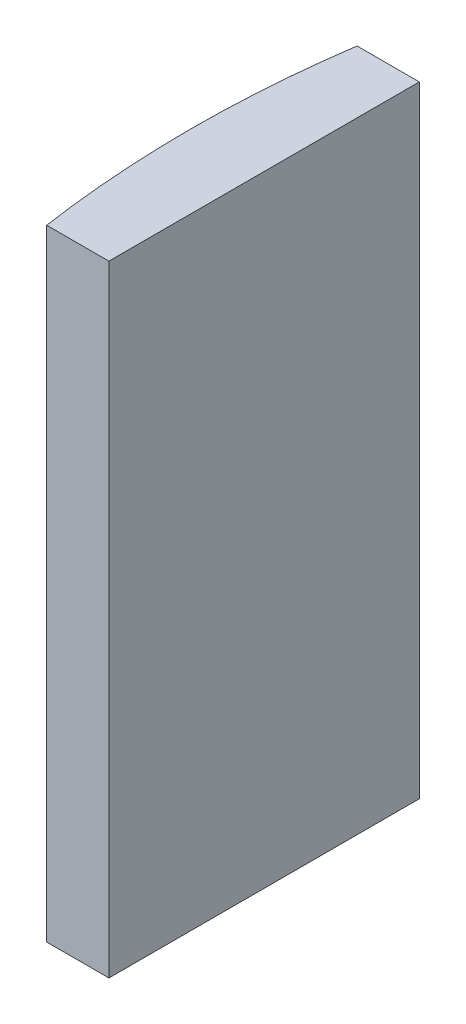
ISO-10303-21;
HEADER;
FILE_DESCRIPTION(('STEP AP214'),'2;1');
FILE_NAME('part.step','',(''),(''),'','','');
FILE_SCHEMA(('AUTOMOTIVE_DESIGN { 1 0 10303 214 1 1 1 1 }'));
ENDSEC;
DATA;
#1=APPLICATION_CONTEXT('core data for automotive mechanical design processes');
#2=APPLICATION_PROTOCOL_DEFINITION('international standard','automotive_design',2000,#1);
#3=PRODUCT_CONTEXT('',#1,'mechanical');
#4=PRODUCT('Part','Part','',(#3));
#5=PRODUCT_RELATED_PRODUCT_CATEGORY('part','',(#4));
#6=PRODUCT_DEFINITION_FORMATION('','',#4);
#7=PRODUCT_DEFINITION_CONTEXT('part definition',#1,'design');
#8=PRODUCT_DEFINITION('design','',#6,#7);
#9=PRODUCT_DEFINITION_SHAPE('','',#8);
#10=(LENGTH_UNIT() NAMED_UNIT(*) SI_UNIT(.MILLI.,.METRE.));
#11=(NAMED_UNIT(*) PLANE_ANGLE_UNIT() SI_UNIT($,.RADIAN.));
#12=(NAMED_UNIT(*) SI_UNIT($,.STERADIAN.) SOLID_ANGLE_UNIT());
#13=UNCERTAINTY_MEASURE_WITH_UNIT(LENGTH_MEASURE(1.E-05),#10,'distance_accuracy_value','');
#14=(GEOMETRIC_REPRESENTATION_CONTEXT(3) GLOBAL_UNCERTAINTY_ASSIGNED_CONTEXT((#13)) GLOBAL_UNIT_ASSIGNED_CONTEXT((#10,
#11,#12)) REPRESENTATION_CONTEXT('',''));
#15=CARTESIAN_POINT('',(0.,0.,0.));
#16=DIRECTION('',(0.,0.,1.));
#17=DIRECTION('',(1.,0.,0.));
#18=AXIS2_PLACEMENT_3D('',#15,#16,#17);
#19=CARTESIAN_POINT('',(4.35520433485127,20.,0.));
#20=DIRECTION('',(0.,-1.,0.));
#21=DIRECTION('',(0.,0.,-1.));
#22=AXIS2_PLACEMENT_3D('',#19,#20,#21);
#23=CYLINDRICAL_SURFACE('',#22,34.35);
#24=CARTESIAN_POINT('',(4.35520433485127,0.,0.));
#25=DIRECTION('',(0.,1.,0.));
#26=DIRECTION('',(0.,0.,1.));
#27=AXIS2_PLACEMENT_3D('',#24,#25,#26);
#28=CIRCLE('',#27,34.35);
#29=CARTESIAN_POINT('',(-29.6289463827995,0.,-5.));
#30=VERTEX_POINT('',#29);
#31=CARTESIAN_POINT('',(-29.6289463827995,0.,5.));
#32=VERTEX_POINT('',#31);
#33=EDGE_CURVE('E100',#30,#32,#28,.T.);
#34=ORIENTED_EDGE('',*,*,#33,.T.);
#35=DIRECTION('',(0.,-1.,0.));
#36=VECTOR('',#35,1.);
#37=CARTESIAN_POINT('',(-29.6289463827995,20.,5.));
#38=LINE('',#37,#36);
#39=CARTESIAN_POINT('',(-29.6289463827995,20.,5.));
#40=VERTEX_POINT('',#39);
#41=EDGE_CURVE('E11',#40,#32,#38,.T.);
#42=ORIENTED_EDGE('',*,*,#41,.F.);
#43=CARTESIAN_POINT('',(4.35520433485127,20.,0.));
#44=DIRECTION('',(0.,1.,0.));
#45=DIRECTION('',(0.,0.,1.));
#46=AXIS2_PLACEMENT_3D('',#43,#44,#45);
#47=CIRCLE('',#46,34.35);
#48=CARTESIAN_POINT('',(-29.6289463827995,20.,-5.));
#49=VERTEX_POINT('',#48);
#50=EDGE_CURVE('E88',#49,#40,#47,.T.);
#51=ORIENTED_EDGE('',*,*,#50,.F.);
#52=DIRECTION('',(0.,-1.,0.));
#53=VECTOR('',#52,1.);
#54=CARTESIAN_POINT('',(-29.6289463827995,20.,-5.));
#55=LINE('',#54,#53);
#56=EDGE_CURVE('E96',#49,#30,#55,.T.);
#57=ORIENTED_EDGE('',*,*,#56,.T.);
#58=EDGE_LOOP('',(#34,#42,#51,#57));
#59=FACE_BOUND('',#58,.T.);
#60=ADVANCED_FACE('F37',(#59),#23,.T.);
#61=CARTESIAN_POINT('',(-29.6289463827995,20.,5.));
#62=DIRECTION('',(0.,0.,-1.));
#63=DIRECTION('',(-1.,0.,0.));
#64=AXIS2_PLACEMENT_3D('',#61,#62,#63);
#65=PLANE('',#64);
#66=DIRECTION('',(1.,0.,0.));
#67=VECTOR('',#66,1.);
#68=CARTESIAN_POINT('',(-29.6289463827995,0.,5.));
#69=LINE('',#68,#67);
#70=CARTESIAN_POINT('',(-27.6247956651487,0.,5.));
#71=VERTEX_POINT('',#70);
#72=EDGE_CURVE('E92',#32,#71,#69,.T.);
#73=ORIENTED_EDGE('',*,*,#72,.T.);
#74=DIRECTION('',(0.,-1.,0.));
#75=VECTOR('',#74,1.);
#76=CARTESIAN_POINT('',(-27.6247956651487,20.,5.));
#77=LINE('',#76,#75);
#78=CARTESIAN_POINT('',(-27.6247956651487,20.,5.));
#79=VERTEX_POINT('',#78);
#80=EDGE_CURVE('E45',#79,#71,#77,.T.);
#81=ORIENTED_EDGE('',*,*,#80,.F.);
#82=DIRECTION('',(1.,0.,0.));
#83=VECTOR('',#82,1.);
#84=CARTESIAN_POINT('',(-29.6289463827995,20.,5.));
#85=LINE('',#84,#83);
#86=EDGE_CURVE('E83',#40,#79,#85,.T.);
#87=ORIENTED_EDGE('',*,*,#86,.F.);
#88=ORIENTED_EDGE('',*,*,#41,.T.);
#89=EDGE_LOOP('',(#73,#81,#87,#88));
#90=FACE_BOUND('',#89,.T.);
#91=ADVANCED_FACE('F91',(#90),#65,.F.);
#92=CARTESIAN_POINT('',(-27.6247956651487,20.,-5.));
#93=DIRECTION('',(-1.,0.,0.));
#94=DIRECTION('',(0.,0.,1.));
#95=AXIS2_PLACEMENT_3D('',#92,#93,#94);
#96=PLANE('',#95);
#97=DIRECTION('',(0.,0.,-1.));
#98=VECTOR('',#97,1.);
#99=CARTESIAN_POINT('',(-27.6247956651487,0.,-5.));
#100=LINE('',#99,#98);
#101=CARTESIAN_POINT('',(-27.6247956651487,0.,-5.));
#102=VERTEX_POINT('',#101);
#103=EDGE_CURVE('E70',#71,#102,#100,.T.);
#104=ORIENTED_EDGE('',*,*,#103,.T.);
#105=DIRECTION('',(0.,-1.,0.));
#106=VECTOR('',#105,1.);
#107=CARTESIAN_POINT('',(-27.6247956651487,20.,-5.));
#108=LINE('',#107,#106);
#109=CARTESIAN_POINT('',(-27.6247956651487,20.,-5.));
#110=VERTEX_POINT('',#109);
#111=EDGE_CURVE('E93',#110,#102,#108,.T.);
#112=ORIENTED_EDGE('',*,*,#111,.F.);
#113=DIRECTION('',(0.,0.,-1.));
#114=VECTOR('',#113,1.);
#115=CARTESIAN_POINT('',(-27.6247956651487,20.,-5.));
#116=LINE('',#115,#114);
#117=EDGE_CURVE('E86',#79,#110,#116,.T.);
#118=ORIENTED_EDGE('',*,*,#117,.F.);
#119=ORIENTED_EDGE('',*,*,#80,.T.);
#120=EDGE_LOOP('',(#104,#112,#118,#119));
#121=FACE_BOUND('',#120,.T.);
#122=ADVANCED_FACE('F94',(#121),#96,.F.);
#123=CARTESIAN_POINT('',(-29.6289463827995,20.,-5.));
#124=DIRECTION('',(0.,0.,1.));
#125=DIRECTION('',(1.,0.,0.));
#126=AXIS2_PLACEMENT_3D('',#123,#124,#125);
#127=PLANE('',#126);
#128=DIRECTION('',(-1.,0.,0.));
#129=VECTOR('',#128,1.);
#130=CARTESIAN_POINT('',(-29.6289463827995,0.,-5.));
#131=LINE('',#130,#129);
#132=EDGE_CURVE('E76',#102,#30,#131,.T.);
#133=ORIENTED_EDGE('',*,*,#132,.T.);
#134=ORIENTED_EDGE('',*,*,#56,.F.);
#135=DIRECTION('',(-1.,0.,0.));
#136=VECTOR('',#135,1.);
#137=CARTESIAN_POINT('',(-29.6289463827995,20.,-5.));
#138=LINE('',#137,#136);
#139=EDGE_CURVE('E53',#110,#49,#138,.T.);
#140=ORIENTED_EDGE('',*,*,#139,.F.);
#141=ORIENTED_EDGE('',*,*,#111,.T.);
#142=EDGE_LOOP('',(#133,#134,#140,#141));
#143=FACE_BOUND('',#142,.T.);
#144=ADVANCED_FACE('F107',(#143),#127,.F.);
#145=CARTESIAN_POINT('',(4.35520433485127,20.,0.));
#146=DIRECTION('',(0.,1.,0.));
#147=DIRECTION('',(0.,0.,1.));
#148=AXIS2_PLACEMENT_3D('',#145,#146,#147);
#149=PLANE('',#148);
#150=ORIENTED_EDGE('',*,*,#50,.T.);
#151=ORIENTED_EDGE('',*,*,#86,.T.);
#152=ORIENTED_EDGE('',*,*,#117,.T.);
#153=ORIENTED_EDGE('',*,*,#139,.T.);
#154=EDGE_LOOP('',(#150,#151,#152,#153));
#155=FACE_BOUND('',#154,.T.);
#156=ADVANCED_FACE('F84',(#155),#149,.T.);
#157=CARTESIAN_POINT('',(4.35520433485127,0.,0.));
#158=DIRECTION('',(0.,1.,0.));
#159=DIRECTION('',(0.,0.,1.));
#160=AXIS2_PLACEMENT_3D('',#157,#158,#159);
#161=PLANE('',#160);
#162=ORIENTED_EDGE('',*,*,#33,.F.);
#163=ORIENTED_EDGE('',*,*,#132,.F.);
#164=ORIENTED_EDGE('',*,*,#103,.F.);
#165=ORIENTED_EDGE('',*,*,#72,.F.);
#166=EDGE_LOOP('',(#162,#163,#164,#165));
#167=FACE_BOUND('',#166,.T.);
#168=ADVANCED_FACE('F110',(#167),#161,.F.);
#169=CLOSED_SHELL('',(#60,#91,#122,#144,#156,#168));
#170=MANIFOLD_SOLID_BREP('B2',#169);
#171=ADVANCED_BREP_SHAPE_REPRESENTATION('',(#18,#170),#14);
#172=SHAPE_DEFINITION_REPRESENTATION(#9,#171);
ENDSEC;
END-ISO-10303-21;
